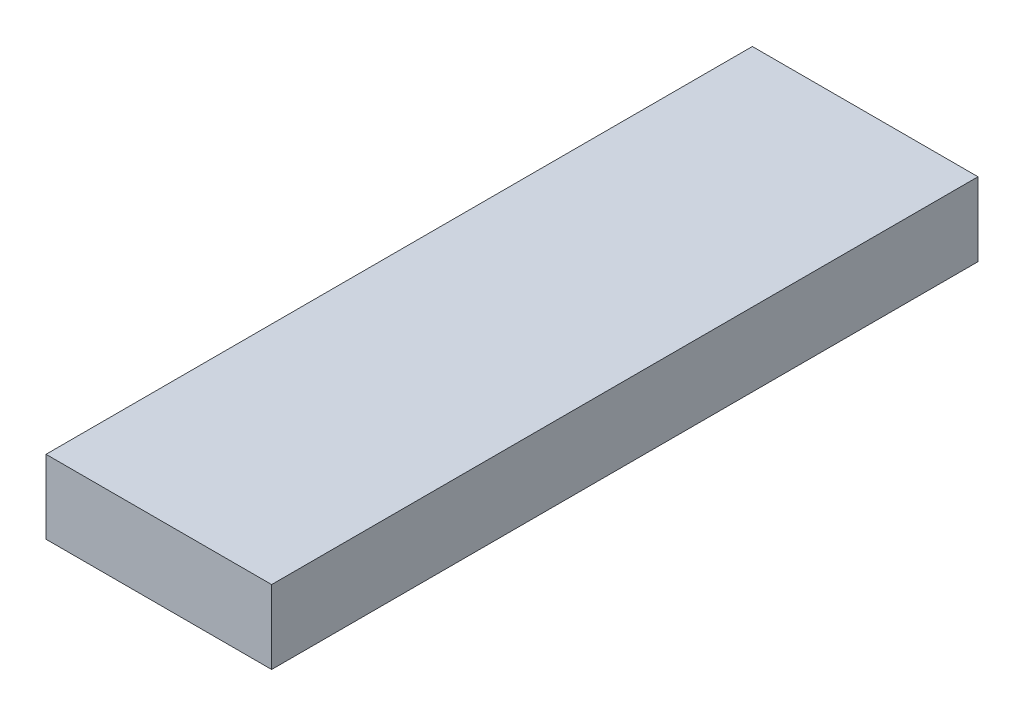
ISO-10303-21;
HEADER;
FILE_DESCRIPTION(('STEP AP214'),'2;1');
FILE_NAME('part.step','',(''),(''),'','','');
FILE_SCHEMA(('AUTOMOTIVE_DESIGN { 1 0 10303 214 1 1 1 1 }'));
ENDSEC;
DATA;
#1=APPLICATION_CONTEXT('core data for automotive mechanical design processes');
#2=APPLICATION_PROTOCOL_DEFINITION('international standard','automotive_design',2000,#1);
#3=PRODUCT_CONTEXT('',#1,'mechanical');
#4=PRODUCT('Part','Part','',(#3));
#5=PRODUCT_RELATED_PRODUCT_CATEGORY('part','',(#4));
#6=PRODUCT_DEFINITION_FORMATION('','',#4);
#7=PRODUCT_DEFINITION_CONTEXT('part definition',#1,'design');
#8=PRODUCT_DEFINITION('design','',#6,#7);
#9=PRODUCT_DEFINITION_SHAPE('','',#8);
#10=(LENGTH_UNIT() NAMED_UNIT(*) SI_UNIT(.MILLI.,.METRE.));
#11=(NAMED_UNIT(*) PLANE_ANGLE_UNIT() SI_UNIT($,.RADIAN.));
#12=(NAMED_UNIT(*) SI_UNIT($,.STERADIAN.) SOLID_ANGLE_UNIT());
#13=UNCERTAINTY_MEASURE_WITH_UNIT(LENGTH_MEASURE(1.E-05),#10,'distance_accuracy_value','');
#14=(GEOMETRIC_REPRESENTATION_CONTEXT(3) GLOBAL_UNCERTAINTY_ASSIGNED_CONTEXT((#13)) GLOBAL_UNIT_ASSIGNED_CONTEXT((#10,
#11,#12)) REPRESENTATION_CONTEXT('',''));
#15=CARTESIAN_POINT('',(0.,0.,0.));
#16=DIRECTION('',(0.,0.,1.));
#17=DIRECTION('',(1.,0.,0.));
#18=AXIS2_PLACEMENT_3D('',#15,#16,#17);
#19=CARTESIAN_POINT('',(-23.,15.,72.));
#20=DIRECTION('',(-1.,0.,0.));
#21=DIRECTION('',(0.,0.,1.));
#22=AXIS2_PLACEMENT_3D('',#19,#20,#21);
#23=PLANE('',#22);
#24=DIRECTION('',(0.,0.,-1.));
#25=VECTOR('',#24,1.);
#26=CARTESIAN_POINT('',(-23.,0.,72.));
#27=LINE('',#26,#25);
#28=CARTESIAN_POINT('',(-23.,0.,72.));
#29=VERTEX_POINT('',#28);
#30=CARTESIAN_POINT('',(-23.,0.,-72.));
#31=VERTEX_POINT('',#30);
#32=EDGE_CURVE('E98',#29,#31,#27,.T.);
#33=ORIENTED_EDGE('',*,*,#32,.F.);
#34=DIRECTION('',(0.,-1.,0.));
#35=VECTOR('',#34,1.);
#36=CARTESIAN_POINT('',(-23.,15.,72.));
#37=LINE('',#36,#35);
#38=CARTESIAN_POINT('',(-23.,15.,72.));
#39=VERTEX_POINT('',#38);
#40=EDGE_CURVE('E11',#39,#29,#37,.T.);
#41=ORIENTED_EDGE('',*,*,#40,.F.);
#42=DIRECTION('',(0.,0.,-1.));
#43=VECTOR('',#42,1.);
#44=CARTESIAN_POINT('',(-23.,15.,72.));
#45=LINE('',#44,#43);
#46=CARTESIAN_POINT('',(-23.,15.,-72.));
#47=VERTEX_POINT('',#46);
#48=EDGE_CURVE('E92',#39,#47,#45,.T.);
#49=ORIENTED_EDGE('',*,*,#48,.T.);
#50=DIRECTION('',(0.,-1.,0.));
#51=VECTOR('',#50,1.);
#52=CARTESIAN_POINT('',(-23.,15.,-72.));
#53=LINE('',#52,#51);
#54=EDGE_CURVE('E37',#47,#31,#53,.T.);
#55=ORIENTED_EDGE('',*,*,#54,.T.);
#56=EDGE_LOOP('',(#33,#41,#49,#55));
#57=FACE_BOUND('',#56,.T.);
#58=ADVANCED_FACE('F34',(#57),#23,.T.);
#59=CARTESIAN_POINT('',(23.,15.,72.));
#60=DIRECTION('',(0.,0.,1.));
#61=DIRECTION('',(1.,0.,0.));
#62=AXIS2_PLACEMENT_3D('',#59,#60,#61);
#63=PLANE('',#62);
#64=DIRECTION('',(-1.,0.,0.));
#65=VECTOR('',#64,1.);
#66=CARTESIAN_POINT('',(23.,0.,72.));
#67=LINE('',#66,#65);
#68=CARTESIAN_POINT('',(23.,0.,72.));
#69=VERTEX_POINT('',#68);
#70=EDGE_CURVE('E94',#69,#29,#67,.T.);
#71=ORIENTED_EDGE('',*,*,#70,.F.);
#72=DIRECTION('',(0.,-1.,0.));
#73=VECTOR('',#72,1.);
#74=CARTESIAN_POINT('',(23.,15.,72.));
#75=LINE('',#74,#73);
#76=CARTESIAN_POINT('',(23.,15.,72.));
#77=VERTEX_POINT('',#76);
#78=EDGE_CURVE('E43',#77,#69,#75,.T.);
#79=ORIENTED_EDGE('',*,*,#78,.F.);
#80=DIRECTION('',(-1.,0.,0.));
#81=VECTOR('',#80,1.);
#82=CARTESIAN_POINT('',(23.,15.,72.));
#83=LINE('',#82,#81);
#84=EDGE_CURVE('E85',#77,#39,#83,.T.);
#85=ORIENTED_EDGE('',*,*,#84,.T.);
#86=ORIENTED_EDGE('',*,*,#40,.T.);
#87=EDGE_LOOP('',(#71,#79,#85,#86));
#88=FACE_BOUND('',#87,.T.);
#89=ADVANCED_FACE('F108',(#88),#63,.T.);
#90=CARTESIAN_POINT('',(23.,15.,72.));
#91=DIRECTION('',(-1.,0.,0.));
#92=DIRECTION('',(0.,0.,1.));
#93=AXIS2_PLACEMENT_3D('',#90,#91,#92);
#94=PLANE('',#93);
#95=DIRECTION('',(0.,0.,-1.));
#96=VECTOR('',#95,1.);
#97=CARTESIAN_POINT('',(23.,0.,72.));
#98=LINE('',#97,#96);
#99=CARTESIAN_POINT('',(23.,0.,-72.));
#100=VERTEX_POINT('',#99);
#101=EDGE_CURVE('E89',#69,#100,#98,.T.);
#102=ORIENTED_EDGE('',*,*,#101,.T.);
#103=DIRECTION('',(0.,-1.,0.));
#104=VECTOR('',#103,1.);
#105=CARTESIAN_POINT('',(23.,15.,-72.));
#106=LINE('',#105,#104);
#107=CARTESIAN_POINT('',(23.,15.,-72.));
#108=VERTEX_POINT('',#107);
#109=EDGE_CURVE('E87',#108,#100,#106,.T.);
#110=ORIENTED_EDGE('',*,*,#109,.F.);
#111=DIRECTION('',(0.,0.,-1.));
#112=VECTOR('',#111,1.);
#113=CARTESIAN_POINT('',(23.,15.,72.));
#114=LINE('',#113,#112);
#115=EDGE_CURVE('E81',#77,#108,#114,.T.);
#116=ORIENTED_EDGE('',*,*,#115,.F.);
#117=ORIENTED_EDGE('',*,*,#78,.T.);
#118=EDGE_LOOP('',(#102,#110,#116,#117));
#119=FACE_BOUND('',#118,.T.);
#120=ADVANCED_FACE('F88',(#119),#94,.F.);
#121=CARTESIAN_POINT('',(-23.,15.,-72.));
#122=DIRECTION('',(0.,0.,-1.));
#123=DIRECTION('',(-1.,0.,0.));
#124=AXIS2_PLACEMENT_3D('',#121,#122,#123);
#125=PLANE('',#124);
#126=DIRECTION('',(1.,0.,0.));
#127=VECTOR('',#126,1.);
#128=CARTESIAN_POINT('',(-23.,0.,-72.));
#129=LINE('',#128,#127);
#130=EDGE_CURVE('E101',#31,#100,#129,.T.);
#131=ORIENTED_EDGE('',*,*,#130,.F.);
#132=ORIENTED_EDGE('',*,*,#54,.F.);
#133=DIRECTION('',(1.,0.,0.));
#134=VECTOR('',#133,1.);
#135=CARTESIAN_POINT('',(-23.,15.,-72.));
#136=LINE('',#135,#134);
#137=EDGE_CURVE('E84',#47,#108,#136,.T.);
#138=ORIENTED_EDGE('',*,*,#137,.T.);
#139=ORIENTED_EDGE('',*,*,#109,.T.);
#140=EDGE_LOOP('',(#131,#132,#138,#139));
#141=FACE_BOUND('',#140,.T.);
#142=ADVANCED_FACE('F91',(#141),#125,.T.);
#143=CARTESIAN_POINT('',(0.,15.,0.));
#144=DIRECTION('',(0.,-1.,0.));
#145=DIRECTION('',(0.,0.,-1.));
#146=AXIS2_PLACEMENT_3D('',#143,#144,#145);
#147=PLANE('',#146);
#148=ORIENTED_EDGE('',*,*,#48,.F.);
#149=ORIENTED_EDGE('',*,*,#84,.F.);
#150=ORIENTED_EDGE('',*,*,#115,.T.);
#151=ORIENTED_EDGE('',*,*,#137,.F.);
#152=EDGE_LOOP('',(#148,#149,#150,#151));
#153=FACE_BOUND('',#152,.T.);
#154=ADVANCED_FACE('F83',(#153),#147,.F.);
#155=CARTESIAN_POINT('',(0.,0.,0.));
#156=DIRECTION('',(0.,-1.,0.));
#157=DIRECTION('',(0.,0.,-1.));
#158=AXIS2_PLACEMENT_3D('',#155,#156,#157);
#159=PLANE('',#158);
#160=ORIENTED_EDGE('',*,*,#32,.T.);
#161=ORIENTED_EDGE('',*,*,#130,.T.);
#162=ORIENTED_EDGE('',*,*,#101,.F.);
#163=ORIENTED_EDGE('',*,*,#70,.T.);
#164=EDGE_LOOP('',(#160,#161,#162,#163));
#165=FACE_BOUND('',#164,.T.);
#166=ADVANCED_FACE('F107',(#165),#159,.T.);
#167=CLOSED_SHELL('',(#58,#89,#120,#142,#154,#166));
#168=MANIFOLD_SOLID_BREP('B2',#167);
#169=ADVANCED_BREP_SHAPE_REPRESENTATION('',(#18,#168),#14);
#170=SHAPE_DEFINITION_REPRESENTATION(#9,#169);
ENDSEC;
END-ISO-10303-21;
